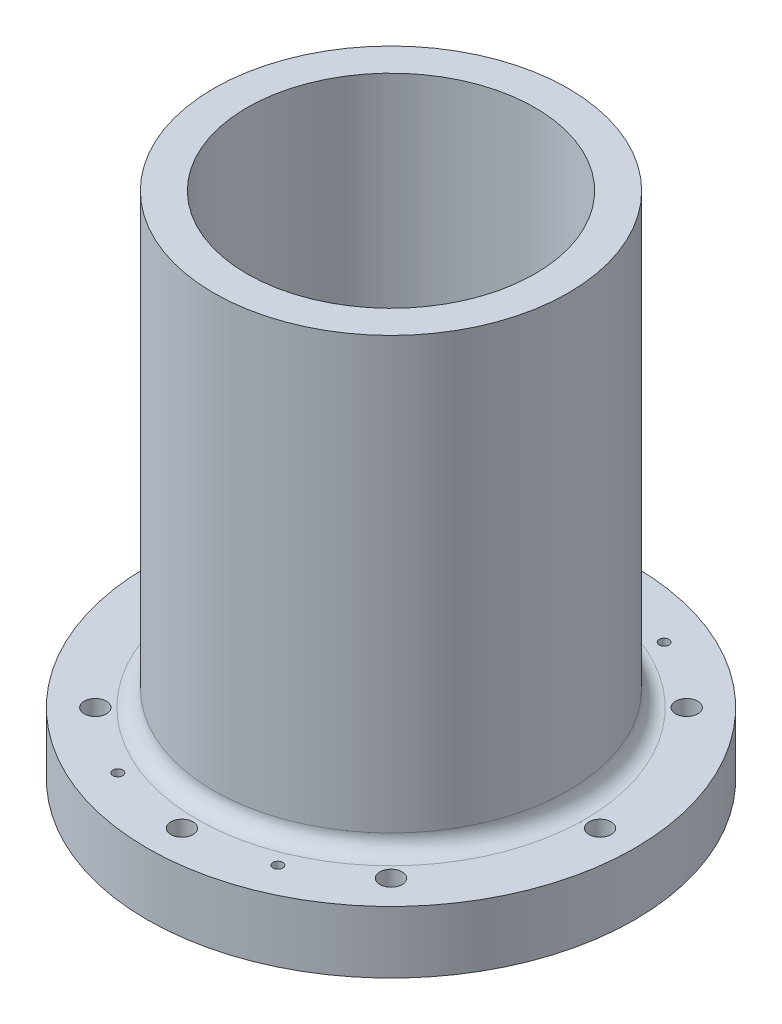
ISO-10303-21;
HEADER;
FILE_DESCRIPTION(('STEP AP214'),'2;1');
FILE_NAME('part.step','',(''),(''),'','','');
FILE_SCHEMA(('AUTOMOTIVE_DESIGN { 1 0 10303 214 1 1 1 1 }'));
ENDSEC;
DATA;
#1=APPLICATION_CONTEXT('core data for automotive mechanical design processes');
#2=APPLICATION_PROTOCOL_DEFINITION('international standard','automotive_design',2000,#1);
#3=PRODUCT_CONTEXT('',#1,'mechanical');
#4=PRODUCT('Part','Part','',(#3));
#5=PRODUCT_RELATED_PRODUCT_CATEGORY('part','',(#4));
#6=PRODUCT_DEFINITION_FORMATION('','',#4);
#7=PRODUCT_DEFINITION_CONTEXT('part definition',#1,'design');
#8=PRODUCT_DEFINITION('design','',#6,#7);
#9=PRODUCT_DEFINITION_SHAPE('','',#8);
#10=(LENGTH_UNIT() NAMED_UNIT(*) SI_UNIT(.MILLI.,.METRE.));
#11=(NAMED_UNIT(*) PLANE_ANGLE_UNIT() SI_UNIT($,.RADIAN.));
#12=(NAMED_UNIT(*) SI_UNIT($,.STERADIAN.) SOLID_ANGLE_UNIT());
#13=UNCERTAINTY_MEASURE_WITH_UNIT(LENGTH_MEASURE(1.E-05),#10,'distance_accuracy_value','');
#14=(GEOMETRIC_REPRESENTATION_CONTEXT(3) GLOBAL_UNCERTAINTY_ASSIGNED_CONTEXT((#13)) GLOBAL_UNIT_ASSIGNED_CONTEXT((#10,
#11,#12)) REPRESENTATION_CONTEXT('',''));
#15=CARTESIAN_POINT('',(0.,0.,0.));
#16=DIRECTION('',(0.,0.,1.));
#17=DIRECTION('',(1.,0.,0.));
#18=AXIS2_PLACEMENT_3D('',#15,#16,#17);
#19=CARTESIAN_POINT('',(0.,292.1,0.));
#20=DIRECTION('',(0.,-1.,0.));
#21=DIRECTION('',(0.,0.,-1.));
#22=AXIS2_PLACEMENT_3D('',#19,#20,#21);
#23=CYLINDRICAL_SURFACE('',#22,50.8);
#24=CARTESIAN_POINT('',(0.,22.5425,0.));
#25=DIRECTION('',(0.,-1.,0.));
#26=DIRECTION('',(0.,0.,-1.));
#27=AXIS2_PLACEMENT_3D('',#24,#25,#26);
#28=CIRCLE('',#27,50.8);
#29=CARTESIAN_POINT('',(0.,22.5425,-50.8));
#30=VERTEX_POINT('',#29);
#31=EDGE_CURVE('E10',#30,#30,#28,.F.);
#32=ORIENTED_EDGE('',*,*,#31,.T.);
#33=EDGE_LOOP('',(#32));
#34=FACE_BOUND('',#33,.T.);
#35=CARTESIAN_POINT('',(0.,146.05,0.));
#36=DIRECTION('',(0.,1.,0.));
#37=DIRECTION('',(0.,0.,1.));
#38=AXIS2_PLACEMENT_3D('',#35,#36,#37);
#39=CIRCLE('',#38,50.8);
#40=CARTESIAN_POINT('',(0.,146.05,50.8));
#41=VERTEX_POINT('',#40);
#42=EDGE_CURVE('E164',#41,#41,#39,.T.);
#43=ORIENTED_EDGE('',*,*,#42,.F.);
#44=EDGE_LOOP('',(#43));
#45=FACE_BOUND('',#44,.T.);
#46=ADVANCED_FACE('F33',(#34,#45),#23,.T.);
#47=CARTESIAN_POINT('',(0.,292.1,0.));
#48=DIRECTION('',(0.,-1.,0.));
#49=DIRECTION('',(0.,0.,-1.));
#50=AXIS2_PLACEMENT_3D('',#47,#48,#49);
#51=CYLINDRICAL_SURFACE('',#50,41.275);
#52=CARTESIAN_POINT('',(0.,0.,0.));
#53=DIRECTION('',(0.,1.,0.));
#54=DIRECTION('',(0.,0.,1.));
#55=AXIS2_PLACEMENT_3D('',#52,#53,#54);
#56=CIRCLE('',#55,41.275);
#57=CARTESIAN_POINT('',(0.,0.,41.275));
#58=VERTEX_POINT('',#57);
#59=EDGE_CURVE('E45',#58,#58,#56,.T.);
#60=ORIENTED_EDGE('',*,*,#59,.F.);
#61=EDGE_LOOP('',(#60));
#62=FACE_BOUND('',#61,.T.);
#63=CARTESIAN_POINT('',(0.,146.05,0.));
#64=DIRECTION('',(0.,1.,0.));
#65=DIRECTION('',(0.,0.,1.));
#66=AXIS2_PLACEMENT_3D('',#63,#64,#65);
#67=CIRCLE('',#66,41.275);
#68=CARTESIAN_POINT('',(0.,146.05,41.275));
#69=VERTEX_POINT('',#68);
#70=EDGE_CURVE('E37',#69,#69,#67,.T.);
#71=ORIENTED_EDGE('',*,*,#70,.T.);
#72=EDGE_LOOP('',(#71));
#73=FACE_BOUND('',#72,.T.);
#74=ADVANCED_FACE('F171',(#62,#73),#51,.F.);
#75=CARTESIAN_POINT('',(0.,0.,0.));
#76=DIRECTION('',(0.,1.,0.));
#77=DIRECTION('',(0.,0.,1.));
#78=AXIS2_PLACEMENT_3D('',#75,#76,#77);
#79=PLANE('',#78);
#80=ORIENTED_EDGE('',*,*,#59,.T.);
#81=EDGE_LOOP('',(#80));
#82=FACE_BOUND('',#81,.T.);
#83=CARTESIAN_POINT('',(0.,0.,0.));
#84=DIRECTION('',(0.,-1.,0.));
#85=DIRECTION('',(0.,0.,-1.));
#86=AXIS2_PLACEMENT_3D('',#83,#84,#85);
#87=CIRCLE('',#86,47.0027);
#88=CARTESIAN_POINT('',(0.,0.,-47.0027));
#89=VERTEX_POINT('',#88);
#90=EDGE_CURVE('E63',#89,#89,#87,.T.);
#91=ORIENTED_EDGE('',*,*,#90,.T.);
#92=EDGE_LOOP('',(#91));
#93=FACE_BOUND('',#92,.T.);
#94=ADVANCED_FACE('F190',(#82,#93),#79,.F.);
#95=CARTESIAN_POINT('',(-22.9298555105109,0.,-55.3575681567308));
#96=DIRECTION('',(0.,-1.,0.));
#97=DIRECTION('',(0.,0.,-1.));
#98=AXIS2_PLACEMENT_3D('',#95,#96,#97);
#99=CIRCLE('',#98,3.175);
#100=CARTESIAN_POINT('',(-22.9298555105109,0.,-58.5325681567308));
#101=VERTEX_POINT('',#100);
#102=EDGE_CURVE('E123',#101,#101,#99,.T.);
#103=ORIENTED_EDGE('',*,*,#102,.F.);
#104=EDGE_LOOP('',(#103));
#105=FACE_BOUND('',#104,.T.);
#106=CARTESIAN_POINT('',(22.9298555105109,0.,55.3575681567307));
#107=DIRECTION('',(0.,-1.,0.));
#108=DIRECTION('',(0.,0.,-1.));
#109=AXIS2_PLACEMENT_3D('',#106,#107,#108);
#110=CIRCLE('',#109,3.175);
#111=CARTESIAN_POINT('',(22.9298555105109,0.,52.1825681567307));
#112=VERTEX_POINT('',#111);
#113=EDGE_CURVE('E130',#112,#112,#110,.T.);
#114=ORIENTED_EDGE('',*,*,#113,.F.);
#115=EDGE_LOOP('',(#114));
#116=FACE_BOUND('',#115,.T.);
#117=CARTESIAN_POINT('',(22.9298555105105,0.,-55.3575681567309));
#118=DIRECTION('',(0.,-1.,0.));
#119=DIRECTION('',(0.,0.,-1.));
#120=AXIS2_PLACEMENT_3D('',#117,#118,#119);
#121=CIRCLE('',#120,3.175);
#122=CARTESIAN_POINT('',(22.9298555105105,0.,-58.5325681567309));
#123=VERTEX_POINT('',#122);
#124=EDGE_CURVE('E136',#123,#123,#121,.T.);
#125=ORIENTED_EDGE('',*,*,#124,.F.);
#126=EDGE_LOOP('',(#125));
#127=FACE_BOUND('',#126,.T.);
#128=CARTESIAN_POINT('',(-22.9298555105105,0.,55.3575681567309));
#129=DIRECTION('',(0.,-1.,0.));
#130=DIRECTION('',(0.,0.,-1.));
#131=AXIS2_PLACEMENT_3D('',#128,#129,#130);
#132=CIRCLE('',#131,3.175);
#133=CARTESIAN_POINT('',(-22.9298555105105,0.,52.1825681567309));
#134=VERTEX_POINT('',#133);
#135=EDGE_CURVE('E117',#134,#134,#132,.T.);
#136=ORIENTED_EDGE('',*,*,#135,.F.);
#137=EDGE_LOOP('',(#136));
#138=FACE_BOUND('',#137,.T.);
#139=CARTESIAN_POINT('',(-59.9186,0.,0.));
#140=DIRECTION('',(0.,1.,0.));
#141=DIRECTION('',(0.,0.,1.));
#142=AXIS2_PLACEMENT_3D('',#139,#140,#141);
#143=CIRCLE('',#142,3.175);
#144=CARTESIAN_POINT('',(-59.9186,0.,3.175));
#145=VERTEX_POINT('',#144);
#146=EDGE_CURVE('E66',#145,#145,#143,.T.);
#147=ORIENTED_EDGE('',*,*,#146,.T.);
#148=EDGE_LOOP('',(#147));
#149=FACE_BOUND('',#148,.T.);
#150=CARTESIAN_POINT('',(-42.3688483792043,0.,42.3688483792043));
#151=DIRECTION('',(0.,1.,0.));
#152=DIRECTION('',(0.,0.,1.));
#153=AXIS2_PLACEMENT_3D('',#150,#151,#152);
#154=CIRCLE('',#153,3.175);
#155=CARTESIAN_POINT('',(-42.3688483792043,0.,45.5438483792043));
#156=VERTEX_POINT('',#155);
#157=EDGE_CURVE('E74',#156,#156,#154,.T.);
#158=ORIENTED_EDGE('',*,*,#157,.T.);
#159=EDGE_LOOP('',(#158));
#160=FACE_BOUND('',#159,.T.);
#161=CARTESIAN_POINT('',(0.,0.,59.9186));
#162=DIRECTION('',(0.,1.,0.));
#163=DIRECTION('',(0.,0.,1.));
#164=AXIS2_PLACEMENT_3D('',#161,#162,#163);
#165=CIRCLE('',#164,3.175);
#166=CARTESIAN_POINT('',(0.,0.,63.0936));
#167=VERTEX_POINT('',#166);
#168=EDGE_CURVE('E80',#167,#167,#165,.T.);
#169=ORIENTED_EDGE('',*,*,#168,.T.);
#170=EDGE_LOOP('',(#169));
#171=FACE_BOUND('',#170,.T.);
#172=CARTESIAN_POINT('',(42.3688483792043,0.,42.3688483792043));
#173=DIRECTION('',(0.,1.,0.));
#174=DIRECTION('',(0.,0.,1.));
#175=AXIS2_PLACEMENT_3D('',#172,#173,#174);
#176=CIRCLE('',#175,3.175);
#177=CARTESIAN_POINT('',(42.3688483792043,0.,45.5438483792043));
#178=VERTEX_POINT('',#177);
#179=EDGE_CURVE('E86',#178,#178,#176,.T.);
#180=ORIENTED_EDGE('',*,*,#179,.T.);
#181=EDGE_LOOP('',(#180));
#182=FACE_BOUND('',#181,.T.);
#183=CARTESIAN_POINT('',(59.9186,0.,0.));
#184=DIRECTION('',(0.,1.,0.));
#185=DIRECTION('',(0.,0.,1.));
#186=AXIS2_PLACEMENT_3D('',#183,#184,#185);
#187=CIRCLE('',#186,3.17500000000001);
#188=CARTESIAN_POINT('',(59.9186,0.,3.17500000000001));
#189=VERTEX_POINT('',#188);
#190=EDGE_CURVE('E92',#189,#189,#187,.T.);
#191=ORIENTED_EDGE('',*,*,#190,.T.);
#192=EDGE_LOOP('',(#191));
#193=FACE_BOUND('',#192,.T.);
#194=CARTESIAN_POINT('',(42.3688483792043,0.,-42.3688483792043));
#195=DIRECTION('',(0.,1.,0.));
#196=DIRECTION('',(0.,0.,1.));
#197=AXIS2_PLACEMENT_3D('',#194,#195,#196);
#198=CIRCLE('',#197,3.17500000000001);
#199=CARTESIAN_POINT('',(42.3688483792043,0.,-39.1938483792043));
#200=VERTEX_POINT('',#199);
#201=EDGE_CURVE('E98',#200,#200,#198,.T.);
#202=ORIENTED_EDGE('',*,*,#201,.T.);
#203=EDGE_LOOP('',(#202));
#204=FACE_BOUND('',#203,.T.);
#205=CARTESIAN_POINT('',(0.,0.,-59.9186));
#206=DIRECTION('',(0.,1.,0.));
#207=DIRECTION('',(0.,0.,1.));
#208=AXIS2_PLACEMENT_3D('',#205,#206,#207);
#209=CIRCLE('',#208,3.175);
#210=CARTESIAN_POINT('',(0.,0.,-56.7436));
#211=VERTEX_POINT('',#210);
#212=EDGE_CURVE('E104',#211,#211,#209,.T.);
#213=ORIENTED_EDGE('',*,*,#212,.T.);
#214=EDGE_LOOP('',(#213));
#215=FACE_BOUND('',#214,.T.);
#216=CARTESIAN_POINT('',(-42.3688483792043,0.,-42.3688483792043));
#217=DIRECTION('',(0.,1.,0.));
#218=DIRECTION('',(0.,0.,1.));
#219=AXIS2_PLACEMENT_3D('',#216,#217,#218);
#220=CIRCLE('',#219,3.17500000000001);
#221=CARTESIAN_POINT('',(-42.3688483792043,0.,-39.1938483792043));
#222=VERTEX_POINT('',#221);
#223=EDGE_CURVE('E110',#222,#222,#220,.T.);
#224=ORIENTED_EDGE('',*,*,#223,.T.);
#225=EDGE_LOOP('',(#224));
#226=FACE_BOUND('',#225,.T.);
#227=CARTESIAN_POINT('',(0.,0.,0.));
#228=DIRECTION('',(0.,-1.,0.));
#229=DIRECTION('',(0.,0.,-1.));
#230=AXIS2_PLACEMENT_3D('',#227,#228,#229);
#231=CIRCLE('',#230,50.0761);
#232=CARTESIAN_POINT('',(0.,0.,-50.0761));
#233=VERTEX_POINT('',#232);
#234=EDGE_CURVE('E57',#233,#233,#231,.T.);
#235=ORIENTED_EDGE('',*,*,#234,.F.);
#236=EDGE_LOOP('',(#235));
#237=FACE_BOUND('',#236,.T.);
#238=CARTESIAN_POINT('',(0.,0.,0.));
#239=DIRECTION('',(0.,-1.,0.));
#240=DIRECTION('',(0.,0.,-1.));
#241=AXIS2_PLACEMENT_3D('',#238,#239,#240);
#242=CIRCLE('',#241,69.85);
#243=CARTESIAN_POINT('',(0.,0.,-69.85));
#244=VERTEX_POINT('',#243);
#245=EDGE_CURVE('E51',#244,#244,#242,.T.);
#246=ORIENTED_EDGE('',*,*,#245,.T.);
#247=EDGE_LOOP('',(#246));
#248=FACE_BOUND('',#247,.T.);
#249=ADVANCED_FACE('F195',(#105,#116,#127,#138,#149,#160,#171,#182,#193,#204,#215,#226,#237,
#248),#79,.F.);
#250=CARTESIAN_POINT('',(0.,17.78,0.));
#251=DIRECTION('',(0.,-1.,0.));
#252=DIRECTION('',(0.,0.,-1.));
#253=AXIS2_PLACEMENT_3D('',#250,#251,#252);
#254=PLANE('',#253);
#255=CARTESIAN_POINT('',(22.9298555105109,17.78,55.3575681567307));
#256=DIRECTION('',(0.,-1.,0.));
#257=DIRECTION('',(0.,0.,-1.));
#258=AXIS2_PLACEMENT_3D('',#255,#256,#257);
#259=CIRCLE('',#258,1.4097);
#260=CARTESIAN_POINT('',(22.9298555105109,17.78,53.9478681567307));
#261=VERTEX_POINT('',#260);
#262=EDGE_CURVE('E146',#261,#261,#259,.F.);
#263=ORIENTED_EDGE('',*,*,#262,.F.);
#264=EDGE_LOOP('',(#263));
#265=FACE_BOUND('',#264,.T.);
#266=CARTESIAN_POINT('',(-22.9298555105109,17.78,-55.3575681567308));
#267=DIRECTION('',(0.,-1.,0.));
#268=DIRECTION('',(0.,0.,-1.));
#269=AXIS2_PLACEMENT_3D('',#266,#267,#268);
#270=CIRCLE('',#269,1.4097);
#271=CARTESIAN_POINT('',(-22.9298555105109,17.78,-56.7672681567308));
#272=VERTEX_POINT('',#271);
#273=EDGE_CURVE('E147',#272,#272,#270,.F.);
#274=ORIENTED_EDGE('',*,*,#273,.F.);
#275=EDGE_LOOP('',(#274));
#276=FACE_BOUND('',#275,.T.);
#277=CARTESIAN_POINT('',(22.9298555105105,17.78,-55.3575681567309));
#278=DIRECTION('',(0.,-1.,0.));
#279=DIRECTION('',(0.,0.,-1.));
#280=AXIS2_PLACEMENT_3D('',#277,#278,#279);
#281=CIRCLE('',#280,1.4097);
#282=CARTESIAN_POINT('',(22.9298555105105,17.78,-56.7672681567309));
#283=VERTEX_POINT('',#282);
#284=EDGE_CURVE('E154',#283,#283,#281,.F.);
#285=ORIENTED_EDGE('',*,*,#284,.F.);
#286=EDGE_LOOP('',(#285));
#287=FACE_BOUND('',#286,.T.);
#288=CARTESIAN_POINT('',(-22.9298555105105,17.78,55.3575681567309));
#289=DIRECTION('',(0.,-1.,0.));
#290=DIRECTION('',(0.,0.,-1.));
#291=AXIS2_PLACEMENT_3D('',#288,#289,#290);
#292=CIRCLE('',#291,1.4097);
#293=CARTESIAN_POINT('',(-22.9298555105105,17.78,53.9478681567309));
#294=VERTEX_POINT('',#293);
#295=EDGE_CURVE('E127',#294,#294,#292,.F.);
#296=ORIENTED_EDGE('',*,*,#295,.F.);
#297=EDGE_LOOP('',(#296));
#298=FACE_BOUND('',#297,.T.);
#299=CARTESIAN_POINT('',(0.,17.78,0.));
#300=DIRECTION('',(0.,-1.,0.));
#301=DIRECTION('',(0.,0.,-1.));
#302=AXIS2_PLACEMENT_3D('',#299,#300,#301);
#303=CIRCLE('',#302,55.5625);
#304=CARTESIAN_POINT('',(0.,17.78,-55.5625));
#305=VERTEX_POINT('',#304);
#306=EDGE_CURVE('E41',#305,#305,#303,.T.);
#307=ORIENTED_EDGE('',*,*,#306,.T.);
#308=EDGE_LOOP('',(#307));
#309=FACE_BOUND('',#308,.T.);
#310=CARTESIAN_POINT('',(-59.9186,17.78,0.));
#311=DIRECTION('',(0.,-1.,0.));
#312=DIRECTION('',(0.,0.,-1.));
#313=AXIS2_PLACEMENT_3D('',#310,#311,#312);
#314=CIRCLE('',#313,3.175);
#315=CARTESIAN_POINT('',(-59.9186,17.78,-3.175));
#316=VERTEX_POINT('',#315);
#317=EDGE_CURVE('E71',#316,#316,#314,.T.);
#318=ORIENTED_EDGE('',*,*,#317,.T.);
#319=EDGE_LOOP('',(#318));
#320=FACE_BOUND('',#319,.T.);
#321=CARTESIAN_POINT('',(-42.3688483792043,17.78,42.3688483792043));
#322=DIRECTION('',(0.,-1.,0.));
#323=DIRECTION('',(0.,0.,-1.));
#324=AXIS2_PLACEMENT_3D('',#321,#322,#323);
#325=CIRCLE('',#324,3.175);
#326=CARTESIAN_POINT('',(-42.3688483792043,17.78,39.1938483792043));
#327=VERTEX_POINT('',#326);
#328=EDGE_CURVE('E77',#327,#327,#325,.T.);
#329=ORIENTED_EDGE('',*,*,#328,.T.);
#330=EDGE_LOOP('',(#329));
#331=FACE_BOUND('',#330,.T.);
#332=CARTESIAN_POINT('',(0.,17.78,59.9186));
#333=DIRECTION('',(0.,-1.,0.));
#334=DIRECTION('',(0.,0.,-1.));
#335=AXIS2_PLACEMENT_3D('',#332,#333,#334);
#336=CIRCLE('',#335,3.175);
#337=CARTESIAN_POINT('',(0.,17.78,56.7436));
#338=VERTEX_POINT('',#337);
#339=EDGE_CURVE('E83',#338,#338,#336,.T.);
#340=ORIENTED_EDGE('',*,*,#339,.T.);
#341=EDGE_LOOP('',(#340));
#342=FACE_BOUND('',#341,.T.);
#343=CARTESIAN_POINT('',(42.3688483792043,17.78,42.3688483792043));
#344=DIRECTION('',(0.,-1.,0.));
#345=DIRECTION('',(0.,0.,-1.));
#346=AXIS2_PLACEMENT_3D('',#343,#344,#345);
#347=CIRCLE('',#346,3.175);
#348=CARTESIAN_POINT('',(42.3688483792043,17.78,39.1938483792043));
#349=VERTEX_POINT('',#348);
#350=EDGE_CURVE('E89',#349,#349,#347,.T.);
#351=ORIENTED_EDGE('',*,*,#350,.T.);
#352=EDGE_LOOP('',(#351));
#353=FACE_BOUND('',#352,.T.);
#354=CARTESIAN_POINT('',(59.9186,17.78,0.));
#355=DIRECTION('',(0.,-1.,0.));
#356=DIRECTION('',(0.,0.,-1.));
#357=AXIS2_PLACEMENT_3D('',#354,#355,#356);
#358=CIRCLE('',#357,3.17500000000001);
#359=CARTESIAN_POINT('',(59.9186,17.78,-3.175));
#360=VERTEX_POINT('',#359);
#361=EDGE_CURVE('E95',#360,#360,#358,.T.);
#362=ORIENTED_EDGE('',*,*,#361,.T.);
#363=EDGE_LOOP('',(#362));
#364=FACE_BOUND('',#363,.T.);
#365=CARTESIAN_POINT('',(42.3688483792043,17.78,-42.3688483792043));
#366=DIRECTION('',(0.,-1.,0.));
#367=DIRECTION('',(0.,0.,-1.));
#368=AXIS2_PLACEMENT_3D('',#365,#366,#367);
#369=CIRCLE('',#368,3.17500000000001);
#370=CARTESIAN_POINT('',(42.3688483792043,17.78,-45.5438483792043));
#371=VERTEX_POINT('',#370);
#372=EDGE_CURVE('E101',#371,#371,#369,.T.);
#373=ORIENTED_EDGE('',*,*,#372,.T.);
#374=EDGE_LOOP('',(#373));
#375=FACE_BOUND('',#374,.T.);
#376=CARTESIAN_POINT('',(0.,17.78,-59.9186));
#377=DIRECTION('',(0.,-1.,0.));
#378=DIRECTION('',(0.,0.,-1.));
#379=AXIS2_PLACEMENT_3D('',#376,#377,#378);
#380=CIRCLE('',#379,3.175);
#381=CARTESIAN_POINT('',(0.,17.78,-63.0936));
#382=VERTEX_POINT('',#381);
#383=EDGE_CURVE('E107',#382,#382,#380,.T.);
#384=ORIENTED_EDGE('',*,*,#383,.T.);
#385=EDGE_LOOP('',(#384));
#386=FACE_BOUND('',#385,.T.);
#387=CARTESIAN_POINT('',(-42.3688483792043,17.78,-42.3688483792043));
#388=DIRECTION('',(0.,-1.,0.));
#389=DIRECTION('',(0.,0.,-1.));
#390=AXIS2_PLACEMENT_3D('',#387,#388,#389);
#391=CIRCLE('',#390,3.17500000000001);
#392=CARTESIAN_POINT('',(-42.3688483792043,17.78,-45.5438483792043));
#393=VERTEX_POINT('',#392);
#394=EDGE_CURVE('E113',#393,#393,#391,.T.);
#395=ORIENTED_EDGE('',*,*,#394,.T.);
#396=EDGE_LOOP('',(#395));
#397=FACE_BOUND('',#396,.T.);
#398=CARTESIAN_POINT('',(0.,17.78,0.));
#399=DIRECTION('',(0.,-1.,0.));
#400=DIRECTION('',(0.,0.,-1.));
#401=AXIS2_PLACEMENT_3D('',#398,#399,#400);
#402=CIRCLE('',#401,69.85);
#403=CARTESIAN_POINT('',(0.,17.78,-69.85));
#404=VERTEX_POINT('',#403);
#405=EDGE_CURVE('E50',#404,#404,#402,.T.);
#406=ORIENTED_EDGE('',*,*,#405,.F.);
#407=EDGE_LOOP('',(#406));
#408=FACE_BOUND('',#407,.T.);
#409=ADVANCED_FACE('F197',(#265,#276,#287,#298,#309,#320,#331,#342,#353,#364,#375,#386,#397,
#408),#254,.F.);
#410=CARTESIAN_POINT('',(0.,17.78,0.));
#411=DIRECTION('',(0.,-1.,0.));
#412=DIRECTION('',(0.,0.,-1.));
#413=AXIS2_PLACEMENT_3D('',#410,#411,#412);
#414=CYLINDRICAL_SURFACE('',#413,69.85);
#415=ORIENTED_EDGE('',*,*,#405,.T.);
#416=EDGE_LOOP('',(#415));
#417=FACE_BOUND('',#416,.T.);
#418=ORIENTED_EDGE('',*,*,#245,.F.);
#419=EDGE_LOOP('',(#418));
#420=FACE_BOUND('',#419,.T.);
#421=ADVANCED_FACE('F200',(#417,#420),#414,.T.);
#422=CARTESIAN_POINT('',(0.,1.9812,0.));
#423=DIRECTION('',(0.,-1.,0.));
#424=DIRECTION('',(0.,0.,-1.));
#425=AXIS2_PLACEMENT_3D('',#422,#423,#424);
#426=CYLINDRICAL_SURFACE('',#425,50.0761);
#427=CARTESIAN_POINT('',(0.,1.9812,0.));
#428=DIRECTION('',(0.,-1.,0.));
#429=DIRECTION('',(0.,0.,-1.));
#430=AXIS2_PLACEMENT_3D('',#427,#428,#429);
#431=CIRCLE('',#430,50.0761);
#432=CARTESIAN_POINT('',(0.,1.9812,-50.0761));
#433=VERTEX_POINT('',#432);
#434=EDGE_CURVE('E54',#433,#433,#431,.T.);
#435=ORIENTED_EDGE('',*,*,#434,.F.);
#436=EDGE_LOOP('',(#435));
#437=FACE_BOUND('',#436,.T.);
#438=ORIENTED_EDGE('',*,*,#234,.T.);
#439=EDGE_LOOP('',(#438));
#440=FACE_BOUND('',#439,.T.);
#441=ADVANCED_FACE('F203',(#437,#440),#426,.F.);
#442=CARTESIAN_POINT('',(0.,1.9812,0.));
#443=DIRECTION('',(0.,-1.,0.));
#444=DIRECTION('',(0.,0.,-1.));
#445=AXIS2_PLACEMENT_3D('',#442,#443,#444);
#446=PLANE('',#445);
#447=CARTESIAN_POINT('',(0.,1.9812,0.));
#448=DIRECTION('',(0.,-1.,0.));
#449=DIRECTION('',(0.,0.,-1.));
#450=AXIS2_PLACEMENT_3D('',#447,#448,#449);
#451=CIRCLE('',#450,47.0027);
#452=CARTESIAN_POINT('',(0.,1.9812,-47.0027));
#453=VERTEX_POINT('',#452);
#454=EDGE_CURVE('E60',#453,#453,#451,.T.);
#455=ORIENTED_EDGE('',*,*,#454,.F.);
#456=EDGE_LOOP('',(#455));
#457=FACE_BOUND('',#456,.T.);
#458=ORIENTED_EDGE('',*,*,#434,.T.);
#459=EDGE_LOOP('',(#458));
#460=FACE_BOUND('',#459,.T.);
#461=ADVANCED_FACE('F210',(#457,#460),#446,.T.);
#462=CARTESIAN_POINT('',(0.,1.9812,0.));
#463=DIRECTION('',(0.,-1.,0.));
#464=DIRECTION('',(0.,0.,-1.));
#465=AXIS2_PLACEMENT_3D('',#462,#463,#464);
#466=CYLINDRICAL_SURFACE('',#465,47.0027);
#467=ORIENTED_EDGE('',*,*,#454,.T.);
#468=EDGE_LOOP('',(#467));
#469=FACE_BOUND('',#468,.T.);
#470=ORIENTED_EDGE('',*,*,#90,.F.);
#471=EDGE_LOOP('',(#470));
#472=FACE_BOUND('',#471,.T.);
#473=ADVANCED_FACE('F214',(#469,#472),#466,.T.);
#474=CARTESIAN_POINT('',(-42.3688483792043,292.1,-42.3688483792043));
#475=DIRECTION('',(0.,-1.,0.));
#476=DIRECTION('',(0.,0.,-1.));
#477=AXIS2_PLACEMENT_3D('',#474,#475,#476);
#478=CYLINDRICAL_SURFACE('',#477,3.17500000000001);
#479=ORIENTED_EDGE('',*,*,#394,.F.);
#480=EDGE_LOOP('',(#479));
#481=FACE_BOUND('',#480,.T.);
#482=ORIENTED_EDGE('',*,*,#223,.F.);
#483=EDGE_LOOP('',(#482));
#484=FACE_BOUND('',#483,.T.);
#485=ADVANCED_FACE('F218',(#481,#484),#478,.F.);
#486=CARTESIAN_POINT('',(0.,292.1,-59.9186));
#487=DIRECTION('',(0.,-1.,0.));
#488=DIRECTION('',(0.,0.,-1.));
#489=AXIS2_PLACEMENT_3D('',#486,#487,#488);
#490=CYLINDRICAL_SURFACE('',#489,3.175);
#491=ORIENTED_EDGE('',*,*,#383,.F.);
#492=EDGE_LOOP('',(#491));
#493=FACE_BOUND('',#492,.T.);
#494=ORIENTED_EDGE('',*,*,#212,.F.);
#495=EDGE_LOOP('',(#494));
#496=FACE_BOUND('',#495,.T.);
#497=ADVANCED_FACE('F222',(#493,#496),#490,.F.);
#498=CARTESIAN_POINT('',(42.3688483792043,292.1,-42.3688483792043));
#499=DIRECTION('',(0.,-1.,0.));
#500=DIRECTION('',(0.,0.,-1.));
#501=AXIS2_PLACEMENT_3D('',#498,#499,#500);
#502=CYLINDRICAL_SURFACE('',#501,3.17500000000001);
#503=ORIENTED_EDGE('',*,*,#372,.F.);
#504=EDGE_LOOP('',(#503));
#505=FACE_BOUND('',#504,.T.);
#506=ORIENTED_EDGE('',*,*,#201,.F.);
#507=EDGE_LOOP('',(#506));
#508=FACE_BOUND('',#507,.T.);
#509=ADVANCED_FACE('F226',(#505,#508),#502,.F.);
#510=CARTESIAN_POINT('',(59.9186,292.1,0.));
#511=DIRECTION('',(0.,-1.,0.));
#512=DIRECTION('',(0.,0.,-1.));
#513=AXIS2_PLACEMENT_3D('',#510,#511,#512);
#514=CYLINDRICAL_SURFACE('',#513,3.17500000000001);
#515=ORIENTED_EDGE('',*,*,#361,.F.);
#516=EDGE_LOOP('',(#515));
#517=FACE_BOUND('',#516,.T.);
#518=ORIENTED_EDGE('',*,*,#190,.F.);
#519=EDGE_LOOP('',(#518));
#520=FACE_BOUND('',#519,.T.);
#521=ADVANCED_FACE('F230',(#517,#520),#514,.F.);
#522=CARTESIAN_POINT('',(42.3688483792043,292.1,42.3688483792043));
#523=DIRECTION('',(0.,-1.,0.));
#524=DIRECTION('',(0.,0.,-1.));
#525=AXIS2_PLACEMENT_3D('',#522,#523,#524);
#526=CYLINDRICAL_SURFACE('',#525,3.175);
#527=ORIENTED_EDGE('',*,*,#350,.F.);
#528=EDGE_LOOP('',(#527));
#529=FACE_BOUND('',#528,.T.);
#530=ORIENTED_EDGE('',*,*,#179,.F.);
#531=EDGE_LOOP('',(#530));
#532=FACE_BOUND('',#531,.T.);
#533=ADVANCED_FACE('F234',(#529,#532),#526,.F.);
#534=CARTESIAN_POINT('',(0.,292.1,59.9186));
#535=DIRECTION('',(0.,-1.,0.));
#536=DIRECTION('',(0.,0.,-1.));
#537=AXIS2_PLACEMENT_3D('',#534,#535,#536);
#538=CYLINDRICAL_SURFACE('',#537,3.175);
#539=ORIENTED_EDGE('',*,*,#339,.F.);
#540=EDGE_LOOP('',(#539));
#541=FACE_BOUND('',#540,.T.);
#542=ORIENTED_EDGE('',*,*,#168,.F.);
#543=EDGE_LOOP('',(#542));
#544=FACE_BOUND('',#543,.T.);
#545=ADVANCED_FACE('F238',(#541,#544),#538,.F.);
#546=CARTESIAN_POINT('',(-42.3688483792043,292.1,42.3688483792043));
#547=DIRECTION('',(0.,-1.,0.));
#548=DIRECTION('',(0.,0.,-1.));
#549=AXIS2_PLACEMENT_3D('',#546,#547,#548);
#550=CYLINDRICAL_SURFACE('',#549,3.175);
#551=ORIENTED_EDGE('',*,*,#328,.F.);
#552=EDGE_LOOP('',(#551));
#553=FACE_BOUND('',#552,.T.);
#554=ORIENTED_EDGE('',*,*,#157,.F.);
#555=EDGE_LOOP('',(#554));
#556=FACE_BOUND('',#555,.T.);
#557=ADVANCED_FACE('F242',(#553,#556),#550,.F.);
#558=CARTESIAN_POINT('',(-59.9186,292.1,0.));
#559=DIRECTION('',(0.,-1.,0.));
#560=DIRECTION('',(0.,0.,-1.));
#561=AXIS2_PLACEMENT_3D('',#558,#559,#560);
#562=CYLINDRICAL_SURFACE('',#561,3.175);
#563=ORIENTED_EDGE('',*,*,#317,.F.);
#564=EDGE_LOOP('',(#563));
#565=FACE_BOUND('',#564,.T.);
#566=ORIENTED_EDGE('',*,*,#146,.F.);
#567=EDGE_LOOP('',(#566));
#568=FACE_BOUND('',#567,.T.);
#569=ADVANCED_FACE('F246',(#565,#568),#562,.F.);
#570=CARTESIAN_POINT('',(0.,22.5425,0.));
#571=DIRECTION('',(0.,-1.,0.));
#572=DIRECTION('',(0.,0.,-1.));
#573=AXIS2_PLACEMENT_3D('',#570,#571,#572);
#574=TOROIDAL_SURFACE('',#573,55.5625,4.7625);
#575=ORIENTED_EDGE('',*,*,#31,.F.);
#576=EDGE_LOOP('',(#575));
#577=FACE_BOUND('',#576,.T.);
#578=ORIENTED_EDGE('',*,*,#306,.F.);
#579=EDGE_LOOP('',(#578));
#580=FACE_BOUND('',#579,.T.);
#581=ADVANCED_FACE('F35',(#577,#580),#574,.F.);
#582=CARTESIAN_POINT('',(-22.9298555105105,7.62,55.3575681567309));
#583=DIRECTION('',(0.,-1.,0.));
#584=DIRECTION('',(0.,0.,-1.));
#585=AXIS2_PLACEMENT_3D('',#582,#583,#584);
#586=CYLINDRICAL_SURFACE('',#585,3.175);
#587=CARTESIAN_POINT('',(-22.9298555105105,7.62,55.3575681567309));
#588=DIRECTION('',(0.,-1.,0.));
#589=DIRECTION('',(0.,0.,-1.));
#590=AXIS2_PLACEMENT_3D('',#587,#588,#589);
#591=CIRCLE('',#590,3.175);
#592=CARTESIAN_POINT('',(-22.9298555105105,7.62,52.1825681567309));
#593=VERTEX_POINT('',#592);
#594=EDGE_CURVE('E116',#593,#593,#591,.T.);
#595=ORIENTED_EDGE('',*,*,#594,.F.);
#596=EDGE_LOOP('',(#595));
#597=FACE_BOUND('',#596,.T.);
#598=ORIENTED_EDGE('',*,*,#135,.T.);
#599=EDGE_LOOP('',(#598));
#600=FACE_BOUND('',#599,.T.);
#601=ADVANCED_FACE('F251',(#597,#600),#586,.F.);
#602=CARTESIAN_POINT('',(-22.9298555105105,7.62,55.3575681567309));
#603=DIRECTION('',(0.,-1.,0.));
#604=DIRECTION('',(0.,0.,-1.));
#605=AXIS2_PLACEMENT_3D('',#602,#603,#604);
#606=PLANE('',#605);
#607=CARTESIAN_POINT('',(-22.9298555105105,7.62,55.3575681567309));
#608=DIRECTION('',(0.,-1.,0.));
#609=DIRECTION('',(0.,0.,-1.));
#610=AXIS2_PLACEMENT_3D('',#607,#608,#609);
#611=CIRCLE('',#610,1.4097);
#612=CARTESIAN_POINT('',(-22.9298555105105,7.62,53.9478681567309));
#613=VERTEX_POINT('',#612);
#614=EDGE_CURVE('E143',#613,#613,#611,.T.);
#615=ORIENTED_EDGE('',*,*,#614,.F.);
#616=EDGE_LOOP('',(#615));
#617=FACE_BOUND('',#616,.T.);
#618=ORIENTED_EDGE('',*,*,#594,.T.);
#619=EDGE_LOOP('',(#618));
#620=FACE_BOUND('',#619,.T.);
#621=ADVANCED_FACE('F254',(#617,#620),#606,.T.);
#622=CARTESIAN_POINT('',(22.9298555105105,7.62,-55.3575681567309));
#623=DIRECTION('',(0.,-1.,0.));
#624=DIRECTION('',(0.,0.,-1.));
#625=AXIS2_PLACEMENT_3D('',#622,#623,#624);
#626=CYLINDRICAL_SURFACE('',#625,3.175);
#627=CARTESIAN_POINT('',(22.9298555105105,7.62,-55.3575681567309));
#628=DIRECTION('',(0.,-1.,0.));
#629=DIRECTION('',(0.,0.,-1.));
#630=AXIS2_PLACEMENT_3D('',#627,#628,#629);
#631=CIRCLE('',#630,3.175);
#632=CARTESIAN_POINT('',(22.9298555105105,7.62,-58.5325681567309));
#633=VERTEX_POINT('',#632);
#634=EDGE_CURVE('E120',#633,#633,#631,.T.);
#635=ORIENTED_EDGE('',*,*,#634,.F.);
#636=EDGE_LOOP('',(#635));
#637=FACE_BOUND('',#636,.T.);
#638=ORIENTED_EDGE('',*,*,#124,.T.);
#639=EDGE_LOOP('',(#638));
#640=FACE_BOUND('',#639,.T.);
#641=ADVANCED_FACE('F258',(#637,#640),#626,.F.);
#642=CARTESIAN_POINT('',(22.9298555105105,7.62,-55.3575681567309));
#643=DIRECTION('',(0.,-1.,0.));
#644=DIRECTION('',(0.,0.,-1.));
#645=AXIS2_PLACEMENT_3D('',#642,#643,#644);
#646=PLANE('',#645);
#647=CARTESIAN_POINT('',(22.9298555105105,7.62,-55.3575681567309));
#648=DIRECTION('',(0.,-1.,0.));
#649=DIRECTION('',(0.,0.,-1.));
#650=AXIS2_PLACEMENT_3D('',#647,#648,#649);
#651=CIRCLE('',#650,1.4097);
#652=CARTESIAN_POINT('',(22.9298555105105,7.62,-56.7672681567309));
#653=VERTEX_POINT('',#652);
#654=EDGE_CURVE('E161',#653,#653,#651,.T.);
#655=ORIENTED_EDGE('',*,*,#654,.F.);
#656=EDGE_LOOP('',(#655));
#657=FACE_BOUND('',#656,.T.);
#658=ORIENTED_EDGE('',*,*,#634,.T.);
#659=EDGE_LOOP('',(#658));
#660=FACE_BOUND('',#659,.T.);
#661=ADVANCED_FACE('F273',(#657,#660),#646,.T.);
#662=CARTESIAN_POINT('',(22.9298555105109,7.62,55.3575681567307));
#663=DIRECTION('',(0.,-1.,0.));
#664=DIRECTION('',(0.,0.,-1.));
#665=AXIS2_PLACEMENT_3D('',#662,#663,#664);
#666=CYLINDRICAL_SURFACE('',#665,3.175);
#667=CARTESIAN_POINT('',(22.9298555105109,7.62,55.3575681567307));
#668=DIRECTION('',(0.,-1.,0.));
#669=DIRECTION('',(0.,0.,-1.));
#670=AXIS2_PLACEMENT_3D('',#667,#668,#669);
#671=CIRCLE('',#670,3.175);
#672=CARTESIAN_POINT('',(22.9298555105109,7.62,52.1825681567307));
#673=VERTEX_POINT('',#672);
#674=EDGE_CURVE('E133',#673,#673,#671,.T.);
#675=ORIENTED_EDGE('',*,*,#674,.F.);
#676=EDGE_LOOP('',(#675));
#677=FACE_BOUND('',#676,.T.);
#678=ORIENTED_EDGE('',*,*,#113,.T.);
#679=EDGE_LOOP('',(#678));
#680=FACE_BOUND('',#679,.T.);
#681=ADVANCED_FACE('F270',(#677,#680),#666,.F.);
#682=CARTESIAN_POINT('',(22.9298555105109,7.62,55.3575681567307));
#683=DIRECTION('',(0.,-1.,0.));
#684=DIRECTION('',(0.,0.,-1.));
#685=AXIS2_PLACEMENT_3D('',#682,#683,#684);
#686=PLANE('',#685);
#687=CARTESIAN_POINT('',(22.9298555105109,7.62,55.3575681567307));
#688=DIRECTION('',(0.,-1.,0.));
#689=DIRECTION('',(0.,0.,-1.));
#690=AXIS2_PLACEMENT_3D('',#687,#688,#689);
#691=CIRCLE('',#690,1.4097);
#692=CARTESIAN_POINT('',(22.9298555105109,7.62,53.9478681567307));
#693=VERTEX_POINT('',#692);
#694=EDGE_CURVE('E150',#693,#693,#691,.T.);
#695=ORIENTED_EDGE('',*,*,#694,.F.);
#696=EDGE_LOOP('',(#695));
#697=FACE_BOUND('',#696,.T.);
#698=ORIENTED_EDGE('',*,*,#674,.T.);
#699=EDGE_LOOP('',(#698));
#700=FACE_BOUND('',#699,.T.);
#701=ADVANCED_FACE('F264',(#697,#700),#686,.T.);
#702=CARTESIAN_POINT('',(-22.9298555105109,7.62,-55.3575681567308));
#703=DIRECTION('',(0.,-1.,0.));
#704=DIRECTION('',(0.,0.,-1.));
#705=AXIS2_PLACEMENT_3D('',#702,#703,#704);
#706=CYLINDRICAL_SURFACE('',#705,3.175);
#707=CARTESIAN_POINT('',(-22.9298555105109,7.62,-55.3575681567308));
#708=DIRECTION('',(0.,-1.,0.));
#709=DIRECTION('',(0.,0.,-1.));
#710=AXIS2_PLACEMENT_3D('',#707,#708,#709);
#711=CIRCLE('',#710,3.175);
#712=CARTESIAN_POINT('',(-22.9298555105109,7.62,-58.5325681567308));
#713=VERTEX_POINT('',#712);
#714=EDGE_CURVE('E126',#713,#713,#711,.T.);
#715=ORIENTED_EDGE('',*,*,#714,.F.);
#716=EDGE_LOOP('',(#715));
#717=FACE_BOUND('',#716,.T.);
#718=ORIENTED_EDGE('',*,*,#102,.T.);
#719=EDGE_LOOP('',(#718));
#720=FACE_BOUND('',#719,.T.);
#721=ADVANCED_FACE('F260',(#717,#720),#706,.F.);
#722=CARTESIAN_POINT('',(-22.9298555105109,7.62,-55.3575681567308));
#723=DIRECTION('',(0.,-1.,0.));
#724=DIRECTION('',(0.,0.,-1.));
#725=AXIS2_PLACEMENT_3D('',#722,#723,#724);
#726=PLANE('',#725);
#727=CARTESIAN_POINT('',(-22.9298555105109,7.62,-55.3575681567308));
#728=DIRECTION('',(0.,-1.,0.));
#729=DIRECTION('',(0.,0.,-1.));
#730=AXIS2_PLACEMENT_3D('',#727,#728,#729);
#731=CIRCLE('',#730,1.4097);
#732=CARTESIAN_POINT('',(-22.9298555105109,7.62,-56.7672681567308));
#733=VERTEX_POINT('',#732);
#734=EDGE_CURVE('E151',#733,#733,#731,.T.);
#735=ORIENTED_EDGE('',*,*,#734,.F.);
#736=EDGE_LOOP('',(#735));
#737=FACE_BOUND('',#736,.T.);
#738=ORIENTED_EDGE('',*,*,#714,.T.);
#739=EDGE_LOOP('',(#738));
#740=FACE_BOUND('',#739,.T.);
#741=ADVANCED_FACE('F263',(#737,#740),#726,.T.);
#742=CARTESIAN_POINT('',(-22.9298555105105,292.101,55.3575681567309));
#743=DIRECTION('',(0.,-1.,0.));
#744=DIRECTION('',(0.,0.,-1.));
#745=AXIS2_PLACEMENT_3D('',#742,#743,#744);
#746=CYLINDRICAL_SURFACE('',#745,1.4097);
#747=ORIENTED_EDGE('',*,*,#614,.T.);
#748=EDGE_LOOP('',(#747));
#749=FACE_BOUND('',#748,.T.);
#750=ORIENTED_EDGE('',*,*,#295,.T.);
#751=EDGE_LOOP('',(#750));
#752=FACE_BOUND('',#751,.T.);
#753=ADVANCED_FACE('F268',(#749,#752),#746,.F.);
#754=CARTESIAN_POINT('',(22.9298555105105,292.101,-55.3575681567309));
#755=DIRECTION('',(0.,-1.,0.));
#756=DIRECTION('',(0.,0.,-1.));
#757=AXIS2_PLACEMENT_3D('',#754,#755,#756);
#758=CYLINDRICAL_SURFACE('',#757,1.4097);
#759=ORIENTED_EDGE('',*,*,#654,.T.);
#760=EDGE_LOOP('',(#759));
#761=FACE_BOUND('',#760,.T.);
#762=ORIENTED_EDGE('',*,*,#284,.T.);
#763=EDGE_LOOP('',(#762));
#764=FACE_BOUND('',#763,.T.);
#765=ADVANCED_FACE('F286',(#761,#764),#758,.F.);
#766=CARTESIAN_POINT('',(-22.9298555105109,292.101,-55.3575681567308));
#767=DIRECTION('',(0.,-1.,0.));
#768=DIRECTION('',(0.,0.,-1.));
#769=AXIS2_PLACEMENT_3D('',#766,#767,#768);
#770=CYLINDRICAL_SURFACE('',#769,1.4097);
#771=ORIENTED_EDGE('',*,*,#734,.T.);
#772=EDGE_LOOP('',(#771));
#773=FACE_BOUND('',#772,.T.);
#774=ORIENTED_EDGE('',*,*,#273,.T.);
#775=EDGE_LOOP('',(#774));
#776=FACE_BOUND('',#775,.T.);
#777=ADVANCED_FACE('F181',(#773,#776),#770,.F.);
#778=CARTESIAN_POINT('',(22.9298555105109,292.101,55.3575681567307));
#779=DIRECTION('',(0.,-1.,0.));
#780=DIRECTION('',(0.,0.,-1.));
#781=AXIS2_PLACEMENT_3D('',#778,#779,#780);
#782=CYLINDRICAL_SURFACE('',#781,1.4097);
#783=ORIENTED_EDGE('',*,*,#694,.T.);
#784=EDGE_LOOP('',(#783));
#785=FACE_BOUND('',#784,.T.);
#786=ORIENTED_EDGE('',*,*,#262,.T.);
#787=EDGE_LOOP('',(#786));
#788=FACE_BOUND('',#787,.T.);
#789=ADVANCED_FACE('F175',(#785,#788),#782,.F.);
#790=CARTESIAN_POINT('',(0.,146.05,0.));
#791=DIRECTION('',(0.,1.,0.));
#792=DIRECTION('',(0.,0.,1.));
#793=AXIS2_PLACEMENT_3D('',#790,#791,#792);
#794=PLANE('',#793);
#795=ORIENTED_EDGE('',*,*,#70,.F.);
#796=EDGE_LOOP('',(#795));
#797=FACE_BOUND('',#796,.T.);
#798=ORIENTED_EDGE('',*,*,#42,.T.);
#799=EDGE_LOOP('',(#798));
#800=FACE_BOUND('',#799,.T.);
#801=ADVANCED_FACE('F173',(#797,#800),#794,.T.);
#802=CLOSED_SHELL('',(#46,#74,#94,#249,#409,#421,#441,#461,#473,#485,#497,#509,#521,#533,#545,
#557,#569,#581,#601,#621,#641,#661,#681,#701,#721,#741,#753,#765,#777,#789,#801));
#803=MANIFOLD_SOLID_BREP('B2',#802);
#804=ADVANCED_BREP_SHAPE_REPRESENTATION('',(#18,#803),#14);
#805=SHAPE_DEFINITION_REPRESENTATION(#9,#804);
ENDSEC;
END-ISO-10303-21;
